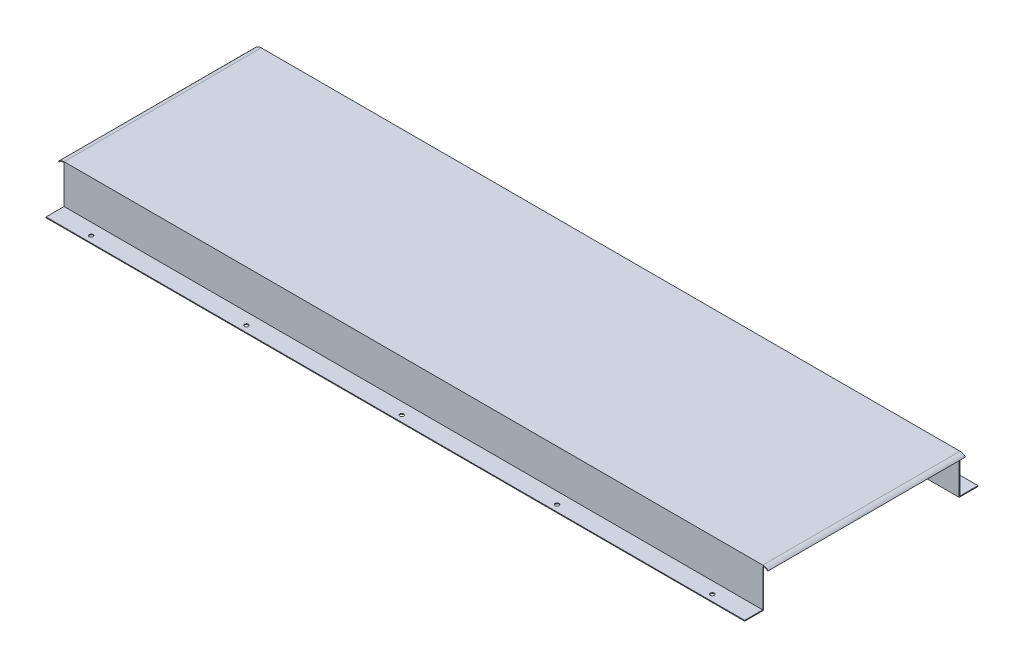
ISO-10303-21;
HEADER;
FILE_DESCRIPTION(('STEP AP214'),'2;1');
FILE_NAME('part.step','',(''),(''),'','','');
FILE_SCHEMA(('AUTOMOTIVE_DESIGN { 1 0 10303 214 1 1 1 1 }'));
ENDSEC;
DATA;
#1=APPLICATION_CONTEXT('core data for automotive mechanical design processes');
#2=APPLICATION_PROTOCOL_DEFINITION('international standard','automotive_design',2000,#1);
#3=PRODUCT_CONTEXT('',#1,'mechanical');
#4=PRODUCT('Part','Part','',(#3));
#5=PRODUCT_RELATED_PRODUCT_CATEGORY('part','',(#4));
#6=PRODUCT_DEFINITION_FORMATION('','',#4);
#7=PRODUCT_DEFINITION_CONTEXT('part definition',#1,'design');
#8=PRODUCT_DEFINITION('design','',#6,#7);
#9=PRODUCT_DEFINITION_SHAPE('','',#8);
#10=(LENGTH_UNIT() NAMED_UNIT(*) SI_UNIT(.MILLI.,.METRE.));
#11=(NAMED_UNIT(*) PLANE_ANGLE_UNIT() SI_UNIT($,.RADIAN.));
#12=(NAMED_UNIT(*) SI_UNIT($,.STERADIAN.) SOLID_ANGLE_UNIT());
#13=UNCERTAINTY_MEASURE_WITH_UNIT(LENGTH_MEASURE(1.E-05),#10,'distance_accuracy_value','');
#14=(GEOMETRIC_REPRESENTATION_CONTEXT(3) GLOBAL_UNCERTAINTY_ASSIGNED_CONTEXT((#13)) GLOBAL_UNIT_ASSIGNED_CONTEXT((#10,
#11,#12)) REPRESENTATION_CONTEXT('',''));
#15=CARTESIAN_POINT('',(0.,0.,0.));
#16=DIRECTION('',(0.,0.,1.));
#17=DIRECTION('',(1.,0.,0.));
#18=AXIS2_PLACEMENT_3D('',#15,#16,#17);
#19=CARTESIAN_POINT('',(-450.,15.5000000000001,254.));
#20=DIRECTION('',(0.,0.,-1.));
#21=DIRECTION('',(1.,0.,0.));
#22=AXIS2_PLACEMENT_3D('',#19,#20,#21);
#23=PLANE('',#22);
#24=DIRECTION('',(-1.,0.,0.));
#25=VECTOR('',#24,1.);
#26=CARTESIAN_POINT('',(-450.,-24.4999999999999,254.));
#27=LINE('',#26,#25);
#28=CARTESIAN_POINT('',(450.,-24.4999999999999,254.));
#29=VERTEX_POINT('',#28);
#30=CARTESIAN_POINT('',(-450.,-24.4999999999999,254.));
#31=VERTEX_POINT('',#30);
#32=EDGE_CURVE('E54',#29,#31,#27,.T.);
#33=ORIENTED_EDGE('',*,*,#32,.F.);
#34=DIRECTION('',(0.,1.,0.));
#35=VECTOR('',#34,1.);
#36=CARTESIAN_POINT('',(450.,25.5000000000001,254.));
#37=LINE('',#36,#35);
#38=CARTESIAN_POINT('',(450.,24.5000000000001,254.));
#39=VERTEX_POINT('',#38);
#40=EDGE_CURVE('E202',#29,#39,#37,.T.);
#41=ORIENTED_EDGE('',*,*,#40,.T.);
#42=CARTESIAN_POINT('',(450.,15.5000000000002,254.));
#43=DIRECTION('',(0.,0.,-1.));
#44=DIRECTION('',(-1.,0.,0.));
#45=AXIS2_PLACEMENT_3D('',#42,#43,#44);
#46=CIRCLE('',#45,8.9999999999999);
#47=CARTESIAN_POINT('',(456.363961030679,21.863961030679,254.));
#48=VERTEX_POINT('',#47);
#49=EDGE_CURVE('E222',#39,#48,#46,.T.);
#50=ORIENTED_EDGE('',*,*,#49,.T.);
#51=DIRECTION('',(0.70710678118653,0.707106781186565,0.));
#52=VECTOR('',#51,1.);
#53=CARTESIAN_POINT('',(456.363961030679,21.863961030679,254.));
#54=LINE('',#53,#52);
#55=CARTESIAN_POINT('',(457.071067811865,22.5710678118656,254.));
#56=VERTEX_POINT('',#55);
#57=EDGE_CURVE('E219',#48,#56,#54,.T.);
#58=ORIENTED_EDGE('',*,*,#57,.T.);
#59=CARTESIAN_POINT('',(450.,15.5000000000002,254.));
#60=DIRECTION('',(0.,0.,1.));
#61=DIRECTION('',(-1.,0.,0.));
#62=AXIS2_PLACEMENT_3D('',#59,#60,#61);
#63=CIRCLE('',#62,9.99999999999989);
#64=CARTESIAN_POINT('',(450.,25.5000000000001,254.));
#65=VERTEX_POINT('',#64);
#66=EDGE_CURVE('E216',#56,#65,#63,.T.);
#67=ORIENTED_EDGE('',*,*,#66,.T.);
#68=DIRECTION('',(-1.,0.,0.));
#69=VECTOR('',#68,1.);
#70=CARTESIAN_POINT('',(450.,25.5000000000001,254.));
#71=LINE('',#70,#69);
#72=CARTESIAN_POINT('',(-450.,25.5,254.));
#73=VERTEX_POINT('',#72);
#74=EDGE_CURVE('E209',#65,#73,#71,.T.);
#75=ORIENTED_EDGE('',*,*,#74,.T.);
#76=CARTESIAN_POINT('',(-450.,15.5000000000001,254.));
#77=DIRECTION('',(0.,0.,1.));
#78=DIRECTION('',(1.,0.,0.));
#79=AXIS2_PLACEMENT_3D('',#76,#77,#78);
#80=CIRCLE('',#79,9.99999999999989);
#81=CARTESIAN_POINT('',(-457.071067811866,22.5710678118655,254.));
#82=VERTEX_POINT('',#81);
#83=EDGE_CURVE('E228',#73,#82,#80,.T.);
#84=ORIENTED_EDGE('',*,*,#83,.T.);
#85=DIRECTION('',(0.707106781186567,-0.707106781186528,0.));
#86=VECTOR('',#85,1.);
#87=CARTESIAN_POINT('',(-456.363961030679,21.863961030679,254.));
#88=LINE('',#87,#86);
#89=CARTESIAN_POINT('',(-456.363961030679,21.863961030679,254.));
#90=VERTEX_POINT('',#89);
#91=EDGE_CURVE('E234',#82,#90,#88,.T.);
#92=ORIENTED_EDGE('',*,*,#91,.T.);
#93=CARTESIAN_POINT('',(-450.,15.5000000000001,254.));
#94=DIRECTION('',(0.,0.,-1.));
#95=DIRECTION('',(1.,0.,0.));
#96=AXIS2_PLACEMENT_3D('',#93,#94,#95);
#97=CIRCLE('',#96,8.99999999999988);
#98=CARTESIAN_POINT('',(-450.,24.4999999999999,254.));
#99=VERTEX_POINT('',#98);
#100=EDGE_CURVE('E231',#90,#99,#97,.T.);
#101=ORIENTED_EDGE('',*,*,#100,.T.);
#102=DIRECTION('',(0.,-1.,0.));
#103=VECTOR('',#102,1.);
#104=CARTESIAN_POINT('',(-450.,25.5,254.));
#105=LINE('',#104,#103);
#106=EDGE_CURVE('E197',#99,#31,#105,.T.);
#107=ORIENTED_EDGE('',*,*,#106,.T.);
#108=EDGE_LOOP('',(#33,#41,#50,#58,#67,#75,#84,#92,#101,#107));
#109=FACE_BOUND('',#108,.T.);
#110=ADVANCED_FACE('F37',(#109),#23,.F.);
#111=CARTESIAN_POINT('',(450.,25.5000000000001,1.));
#112=DIRECTION('',(-1.,0.,0.));
#113=DIRECTION('',(0.,0.,1.));
#114=AXIS2_PLACEMENT_3D('',#111,#112,#113);
#115=PLANE('',#114);
#116=DIRECTION('',(0.,0.,-1.));
#117=VECTOR('',#116,1.);
#118=CARTESIAN_POINT('',(450.,24.5000000000001,127.));
#119=LINE('',#118,#117);
#120=CARTESIAN_POINT('',(450.,24.5000000000001,1.));
#121=VERTEX_POINT('',#120);
#122=CARTESIAN_POINT('',(450.,24.5000000000001,0.));
#123=VERTEX_POINT('',#122);
#124=EDGE_CURVE('E11',#121,#123,#119,.T.);
#125=ORIENTED_EDGE('',*,*,#124,.F.);
#126=DIRECTION('',(0.,1.,0.));
#127=VECTOR('',#126,1.);
#128=CARTESIAN_POINT('',(450.,25.5000000000001,1.));
#129=LINE('',#128,#127);
#130=CARTESIAN_POINT('',(450.,-25.4999999999999,1.));
#131=VERTEX_POINT('',#130);
#132=EDGE_CURVE('E313',#131,#121,#129,.T.);
#133=ORIENTED_EDGE('',*,*,#132,.F.);
#134=DIRECTION('',(0.,0.,-1.));
#135=VECTOR('',#134,1.);
#136=CARTESIAN_POINT('',(450.,-25.4999999999999,1.));
#137=LINE('',#136,#135);
#138=CARTESIAN_POINT('',(450.,-25.4999999999999,-23.25));
#139=VERTEX_POINT('',#138);
#140=EDGE_CURVE('E325',#131,#139,#137,.T.);
#141=ORIENTED_EDGE('',*,*,#140,.T.);
#142=DIRECTION('',(0.,1.,0.));
#143=VECTOR('',#142,1.);
#144=CARTESIAN_POINT('',(450.,-24.4999999999999,-23.25));
#145=LINE('',#144,#143);
#146=CARTESIAN_POINT('',(450.,-24.4999999999999,-23.25));
#147=VERTEX_POINT('',#146);
#148=EDGE_CURVE('E294',#139,#147,#145,.T.);
#149=ORIENTED_EDGE('',*,*,#148,.T.);
#150=DIRECTION('',(0.,0.,1.));
#151=VECTOR('',#150,1.);
#152=CARTESIAN_POINT('',(450.,-24.4999999999999,-23.25));
#153=LINE('',#152,#151);
#154=CARTESIAN_POINT('',(450.,-24.4999999999999,0.));
#155=VERTEX_POINT('',#154);
#156=EDGE_CURVE('E300',#147,#155,#153,.T.);
#157=ORIENTED_EDGE('',*,*,#156,.T.);
#158=DIRECTION('',(0.,1.,0.));
#159=VECTOR('',#158,1.);
#160=CARTESIAN_POINT('',(450.,25.5000000000001,0.));
#161=LINE('',#160,#159);
#162=EDGE_CURVE('E318',#155,#123,#161,.T.);
#163=ORIENTED_EDGE('',*,*,#162,.T.);
#164=EDGE_LOOP('',(#125,#133,#141,#149,#157,#163));
#165=FACE_BOUND('',#164,.T.);
#166=ADVANCED_FACE('F435',(#165),#115,.F.);
#167=CARTESIAN_POINT('',(-400.,-25.5,-15.));
#168=DIRECTION('',(0.,1.,0.));
#169=DIRECTION('',(0.,0.,1.));
#170=AXIS2_PLACEMENT_3D('',#167,#168,#169);
#171=CYLINDRICAL_SURFACE('',#170,2.50000000000002);
#172=CARTESIAN_POINT('',(-400.,-24.4999999999999,-15.));
#173=DIRECTION('',(0.,1.,0.));
#174=DIRECTION('',(0.,0.,1.));
#175=AXIS2_PLACEMENT_3D('',#172,#173,#174);
#176=CIRCLE('',#175,2.50000000000002);
#177=CARTESIAN_POINT('',(-400.,-24.4999999999999,-12.5));
#178=VERTEX_POINT('',#177);
#179=EDGE_CURVE('E343',#178,#178,#176,.T.);
#180=ORIENTED_EDGE('',*,*,#179,.T.);
#181=EDGE_LOOP('',(#180));
#182=FACE_BOUND('',#181,.T.);
#183=CARTESIAN_POINT('',(-400.,-25.5,-15.));
#184=DIRECTION('',(0.,1.,0.));
#185=DIRECTION('',(0.,0.,1.));
#186=AXIS2_PLACEMENT_3D('',#183,#184,#185);
#187=CIRCLE('',#186,2.50000000000002);
#188=CARTESIAN_POINT('',(-400.,-25.5,-12.5));
#189=VERTEX_POINT('',#188);
#190=EDGE_CURVE('E263',#189,#189,#187,.T.);
#191=ORIENTED_EDGE('',*,*,#190,.F.);
#192=EDGE_LOOP('',(#191));
#193=FACE_BOUND('',#192,.T.);
#194=ADVANCED_FACE('F39',(#182,#193),#171,.F.);
#195=CARTESIAN_POINT('',(-200.,-25.5,-15.));
#196=DIRECTION('',(0.,1.,0.));
#197=DIRECTION('',(0.,0.,1.));
#198=AXIS2_PLACEMENT_3D('',#195,#196,#197);
#199=CYLINDRICAL_SURFACE('',#198,2.50000000000002);
#200=CARTESIAN_POINT('',(-200.,-24.4999999999999,-15.));
#201=DIRECTION('',(0.,1.,0.));
#202=DIRECTION('',(0.,0.,1.));
#203=AXIS2_PLACEMENT_3D('',#200,#201,#202);
#204=CIRCLE('',#203,2.50000000000002);
#205=CARTESIAN_POINT('',(-200.,-24.4999999999999,-12.5));
#206=VERTEX_POINT('',#205);
#207=EDGE_CURVE('E337',#206,#206,#204,.T.);
#208=ORIENTED_EDGE('',*,*,#207,.T.);
#209=EDGE_LOOP('',(#208));
#210=FACE_BOUND('',#209,.T.);
#211=CARTESIAN_POINT('',(-200.,-25.5,-15.));
#212=DIRECTION('',(0.,1.,0.));
#213=DIRECTION('',(0.,0.,1.));
#214=AXIS2_PLACEMENT_3D('',#211,#212,#213);
#215=CIRCLE('',#214,2.50000000000002);
#216=CARTESIAN_POINT('',(-200.,-25.5,-12.5));
#217=VERTEX_POINT('',#216);
#218=EDGE_CURVE('E340',#217,#217,#215,.T.);
#219=ORIENTED_EDGE('',*,*,#218,.F.);
#220=EDGE_LOOP('',(#219));
#221=FACE_BOUND('',#220,.T.);
#222=ADVANCED_FACE('F483',(#210,#221),#199,.F.);
#223=CARTESIAN_POINT('',(-4.44089209850063E-13,-25.5,-15.));
#224=DIRECTION('',(0.,1.,0.));
#225=DIRECTION('',(0.,0.,1.));
#226=AXIS2_PLACEMENT_3D('',#223,#224,#225);
#227=CYLINDRICAL_SURFACE('',#226,2.50000000000002);
#228=CARTESIAN_POINT('',(-4.44089209850063E-13,-24.4999999999999,-15.));
#229=DIRECTION('',(0.,1.,0.));
#230=DIRECTION('',(0.,0.,1.));
#231=AXIS2_PLACEMENT_3D('',#228,#229,#230);
#232=CIRCLE('',#231,2.50000000000002);
#233=CARTESIAN_POINT('',(-4.44089209850063E-13,-24.4999999999999,-12.5));
#234=VERTEX_POINT('',#233);
#235=EDGE_CURVE('E329',#234,#234,#232,.T.);
#236=ORIENTED_EDGE('',*,*,#235,.T.);
#237=EDGE_LOOP('',(#236));
#238=FACE_BOUND('',#237,.T.);
#239=CARTESIAN_POINT('',(-4.44089209850063E-13,-25.5,-15.));
#240=DIRECTION('',(0.,1.,0.));
#241=DIRECTION('',(0.,0.,1.));
#242=AXIS2_PLACEMENT_3D('',#239,#240,#241);
#243=CIRCLE('',#242,2.50000000000002);
#244=CARTESIAN_POINT('',(-4.44089209850063E-13,-25.5,-12.5));
#245=VERTEX_POINT('',#244);
#246=EDGE_CURVE('E334',#245,#245,#243,.T.);
#247=ORIENTED_EDGE('',*,*,#246,.F.);
#248=EDGE_LOOP('',(#247));
#249=FACE_BOUND('',#248,.T.);
#250=ADVANCED_FACE('F470',(#238,#249),#227,.F.);
#251=CARTESIAN_POINT('',(0.,0.,1.));
#252=DIRECTION('',(0.,0.,-1.));
#253=DIRECTION('',(-1.,0.,0.));
#254=AXIS2_PLACEMENT_3D('',#251,#252,#253);
#255=PLANE('',#254);
#256=DIRECTION('',(1.,0.,0.));
#257=VECTOR('',#256,1.);
#258=CARTESIAN_POINT('',(-450.,24.5000000000001,1.));
#259=LINE('',#258,#257);
#260=CARTESIAN_POINT('',(-450.,24.4999999999999,1.));
#261=VERTEX_POINT('',#260);
#262=EDGE_CURVE('E278',#261,#121,#259,.T.);
#263=ORIENTED_EDGE('',*,*,#262,.F.);
#264=DIRECTION('',(0.,-1.,0.));
#265=VECTOR('',#264,1.);
#266=CARTESIAN_POINT('',(-450.,25.5,1.));
#267=LINE('',#266,#265);
#268=CARTESIAN_POINT('',(-450.,-25.5,1.));
#269=VERTEX_POINT('',#268);
#270=EDGE_CURVE('E308',#261,#269,#267,.T.);
#271=ORIENTED_EDGE('',*,*,#270,.T.);
#272=DIRECTION('',(1.,0.,0.));
#273=VECTOR('',#272,1.);
#274=CARTESIAN_POINT('',(450.,-25.4999999999999,1.));
#275=LINE('',#274,#273);
#276=EDGE_CURVE('E310',#269,#131,#275,.T.);
#277=ORIENTED_EDGE('',*,*,#276,.T.);
#278=ORIENTED_EDGE('',*,*,#132,.T.);
#279=EDGE_LOOP('',(#263,#271,#277,#278));
#280=FACE_BOUND('',#279,.T.);
#281=ADVANCED_FACE('F468',(#280),#255,.F.);
#282=CARTESIAN_POINT('',(0.,0.,0.));
#283=DIRECTION('',(0.,0.,-1.));
#284=DIRECTION('',(-1.,0.,0.));
#285=AXIS2_PLACEMENT_3D('',#282,#283,#284);
#286=PLANE('',#285);
#287=ORIENTED_EDGE('',*,*,#162,.F.);
#288=DIRECTION('',(-1.,0.,0.));
#289=VECTOR('',#288,1.);
#290=CARTESIAN_POINT('',(-450.,-24.4999999999999,0.));
#291=LINE('',#290,#289);
#292=CARTESIAN_POINT('',(-450.,-24.4999999999999,0.));
#293=VERTEX_POINT('',#292);
#294=EDGE_CURVE('E287',#155,#293,#291,.T.);
#295=ORIENTED_EDGE('',*,*,#294,.T.);
#296=DIRECTION('',(0.,-1.,0.));
#297=VECTOR('',#296,1.);
#298=CARTESIAN_POINT('',(-450.,25.5,0.));
#299=LINE('',#298,#297);
#300=CARTESIAN_POINT('',(-450.,24.4999999999999,0.));
#301=VERTEX_POINT('',#300);
#302=EDGE_CURVE('E306',#301,#293,#299,.T.);
#303=ORIENTED_EDGE('',*,*,#302,.F.);
#304=CARTESIAN_POINT('',(-450.,15.5000000000001,0.));
#305=DIRECTION('',(0.,0.,-1.));
#306=DIRECTION('',(1.,0.,0.));
#307=AXIS2_PLACEMENT_3D('',#304,#305,#306);
#308=CIRCLE('',#307,8.99999999999988);
#309=CARTESIAN_POINT('',(-456.363961030679,21.863961030679,0.));
#310=VERTEX_POINT('',#309);
#311=EDGE_CURVE('E62',#310,#301,#308,.T.);
#312=ORIENTED_EDGE('',*,*,#311,.F.);
#313=DIRECTION('',(0.707106781186567,-0.707106781186528,0.));
#314=VECTOR('',#313,1.);
#315=CARTESIAN_POINT('',(-456.363961030679,21.863961030679,0.));
#316=LINE('',#315,#314);
#317=CARTESIAN_POINT('',(-457.071067811866,22.5710678118655,0.));
#318=VERTEX_POINT('',#317);
#319=EDGE_CURVE('E258',#318,#310,#316,.T.);
#320=ORIENTED_EDGE('',*,*,#319,.F.);
#321=CARTESIAN_POINT('',(-450.,15.5000000000001,0.));
#322=DIRECTION('',(0.,0.,1.));
#323=DIRECTION('',(1.,0.,0.));
#324=AXIS2_PLACEMENT_3D('',#321,#322,#323);
#325=CIRCLE('',#324,9.99999999999989);
#326=CARTESIAN_POINT('',(-450.,25.5,0.));
#327=VERTEX_POINT('',#326);
#328=EDGE_CURVE('E254',#327,#318,#325,.T.);
#329=ORIENTED_EDGE('',*,*,#328,.F.);
#330=DIRECTION('',(-1.,0.,0.));
#331=VECTOR('',#330,1.);
#332=CARTESIAN_POINT('',(450.,25.5000000000001,0.));
#333=LINE('',#332,#331);
#334=CARTESIAN_POINT('',(450.,25.5000000000001,0.));
#335=VERTEX_POINT('',#334);
#336=EDGE_CURVE('E311',#335,#327,#333,.T.);
#337=ORIENTED_EDGE('',*,*,#336,.F.);
#338=CARTESIAN_POINT('',(450.,15.5000000000002,0.));
#339=DIRECTION('',(0.,0.,1.));
#340=DIRECTION('',(-1.,0.,0.));
#341=AXIS2_PLACEMENT_3D('',#338,#339,#340);
#342=CIRCLE('',#341,9.99999999999989);
#343=CARTESIAN_POINT('',(457.071067811865,22.5710678118656,0.));
#344=VERTEX_POINT('',#343);
#345=EDGE_CURVE('E242',#344,#335,#342,.T.);
#346=ORIENTED_EDGE('',*,*,#345,.F.);
#347=DIRECTION('',(0.70710678118653,0.707106781186565,0.));
#348=VECTOR('',#347,1.);
#349=CARTESIAN_POINT('',(456.363961030679,21.863961030679,0.));
#350=LINE('',#349,#348);
#351=CARTESIAN_POINT('',(456.363961030679,21.863961030679,0.));
#352=VERTEX_POINT('',#351);
#353=EDGE_CURVE('E247',#352,#344,#350,.T.);
#354=ORIENTED_EDGE('',*,*,#353,.F.);
#355=CARTESIAN_POINT('',(450.,15.5000000000002,0.));
#356=DIRECTION('',(0.,0.,-1.));
#357=DIRECTION('',(-1.,0.,0.));
#358=AXIS2_PLACEMENT_3D('',#355,#356,#357);
#359=CIRCLE('',#358,8.9999999999999);
#360=EDGE_CURVE('E245',#123,#352,#359,.T.);
#361=ORIENTED_EDGE('',*,*,#360,.F.);
#362=EDGE_LOOP('',(#287,#295,#303,#312,#320,#329,#337,#346,#354,#361));
#363=FACE_BOUND('',#362,.T.);
#364=ADVANCED_FACE('F415',(#363),#286,.T.);
#365=CARTESIAN_POINT('',(-450.,25.5,1.));
#366=DIRECTION('',(1.,0.,0.));
#367=DIRECTION('',(0.,0.,-1.));
#368=AXIS2_PLACEMENT_3D('',#365,#366,#367);
#369=PLANE('',#368);
#370=ORIENTED_EDGE('',*,*,#270,.F.);
#371=DIRECTION('',(0.,0.,-1.));
#372=VECTOR('',#371,1.);
#373=CARTESIAN_POINT('',(-450.,24.4999999999999,127.));
#374=LINE('',#373,#372);
#375=EDGE_CURVE('E46',#261,#301,#374,.T.);
#376=ORIENTED_EDGE('',*,*,#375,.T.);
#377=ORIENTED_EDGE('',*,*,#302,.T.);
#378=DIRECTION('',(0.,0.,1.));
#379=VECTOR('',#378,1.);
#380=CARTESIAN_POINT('',(-450.,-24.4999999999999,-23.25));
#381=LINE('',#380,#379);
#382=CARTESIAN_POINT('',(-450.,-24.4999999999999,-23.25));
#383=VERTEX_POINT('',#382);
#384=EDGE_CURVE('E303',#383,#293,#381,.T.);
#385=ORIENTED_EDGE('',*,*,#384,.F.);
#386=DIRECTION('',(0.,-1.,0.));
#387=VECTOR('',#386,1.);
#388=CARTESIAN_POINT('',(-450.,-25.5,-23.25));
#389=LINE('',#388,#387);
#390=CARTESIAN_POINT('',(-450.,-25.5,-23.25));
#391=VERTEX_POINT('',#390);
#392=EDGE_CURVE('E288',#383,#391,#389,.T.);
#393=ORIENTED_EDGE('',*,*,#392,.T.);
#394=DIRECTION('',(0.,0.,-1.));
#395=VECTOR('',#394,1.);
#396=CARTESIAN_POINT('',(-450.,-25.5,1.));
#397=LINE('',#396,#395);
#398=EDGE_CURVE('E327',#269,#391,#397,.T.);
#399=ORIENTED_EDGE('',*,*,#398,.F.);
#400=EDGE_LOOP('',(#370,#376,#377,#385,#393,#399));
#401=FACE_BOUND('',#400,.T.);
#402=ADVANCED_FACE('F429',(#401),#369,.F.);
#403=CARTESIAN_POINT('',(450.,-25.4999999999999,1.));
#404=DIRECTION('',(0.,1.,0.));
#405=DIRECTION('',(-1.,0.,0.));
#406=AXIS2_PLACEMENT_3D('',#403,#404,#405);
#407=PLANE('',#406);
#408=CARTESIAN_POINT('',(200.,-25.5,-15.));
#409=DIRECTION('',(0.,1.,0.));
#410=DIRECTION('',(0.,0.,1.));
#411=AXIS2_PLACEMENT_3D('',#408,#409,#410);
#412=CIRCLE('',#411,2.50000000000002);
#413=CARTESIAN_POINT('',(200.,-25.5,-12.5));
#414=VERTEX_POINT('',#413);
#415=EDGE_CURVE('E271',#414,#414,#412,.T.);
#416=ORIENTED_EDGE('',*,*,#415,.T.);
#417=EDGE_LOOP('',(#416));
#418=FACE_BOUND('',#417,.T.);
#419=CARTESIAN_POINT('',(400.,-25.5,-15.));
#420=DIRECTION('',(0.,1.,0.));
#421=DIRECTION('',(0.,0.,1.));
#422=AXIS2_PLACEMENT_3D('',#419,#420,#421);
#423=CIRCLE('',#422,2.50000000000002);
#424=CARTESIAN_POINT('',(400.,-25.5,-12.5));
#425=VERTEX_POINT('',#424);
#426=EDGE_CURVE('E274',#425,#425,#423,.T.);
#427=ORIENTED_EDGE('',*,*,#426,.T.);
#428=EDGE_LOOP('',(#427));
#429=FACE_BOUND('',#428,.T.);
#430=ORIENTED_EDGE('',*,*,#398,.T.);
#431=DIRECTION('',(1.,0.,0.));
#432=VECTOR('',#431,1.);
#433=CARTESIAN_POINT('',(450.,-25.4999999999999,-23.25));
#434=LINE('',#433,#432);
#435=EDGE_CURVE('E291',#391,#139,#434,.T.);
#436=ORIENTED_EDGE('',*,*,#435,.T.);
#437=ORIENTED_EDGE('',*,*,#140,.F.);
#438=ORIENTED_EDGE('',*,*,#276,.F.);
#439=EDGE_LOOP('',(#430,#436,#437,#438));
#440=FACE_BOUND('',#439,.T.);
#441=ORIENTED_EDGE('',*,*,#246,.T.);
#442=EDGE_LOOP('',(#441));
#443=FACE_BOUND('',#442,.T.);
#444=ORIENTED_EDGE('',*,*,#218,.T.);
#445=EDGE_LOOP('',(#444));
#446=FACE_BOUND('',#445,.T.);
#447=ORIENTED_EDGE('',*,*,#190,.T.);
#448=EDGE_LOOP('',(#447));
#449=FACE_BOUND('',#448,.T.);
#450=ADVANCED_FACE('F420',(#418,#429,#440,#443,#446,#449),#407,.F.);
#451=CARTESIAN_POINT('',(450.,25.5000000000001,1.));
#452=DIRECTION('',(0.,-1.,0.));
#453=DIRECTION('',(1.,0.,0.));
#454=AXIS2_PLACEMENT_3D('',#451,#452,#453);
#455=PLANE('',#454);
#456=ORIENTED_EDGE('',*,*,#336,.T.);
#457=DIRECTION('',(0.,0.,-1.));
#458=VECTOR('',#457,1.);
#459=CARTESIAN_POINT('',(-450.,25.5,1.));
#460=LINE('',#459,#458);
#461=EDGE_CURVE('E316',#73,#327,#460,.T.);
#462=ORIENTED_EDGE('',*,*,#461,.F.);
#463=ORIENTED_EDGE('',*,*,#74,.F.);
#464=DIRECTION('',(0.,0.,-1.));
#465=VECTOR('',#464,1.);
#466=CARTESIAN_POINT('',(450.,25.5000000000001,1.));
#467=LINE('',#466,#465);
#468=EDGE_CURVE('E323',#65,#335,#467,.T.);
#469=ORIENTED_EDGE('',*,*,#468,.T.);
#470=EDGE_LOOP('',(#456,#462,#463,#469));
#471=FACE_BOUND('',#470,.T.);
#472=ADVANCED_FACE('F417',(#471),#455,.F.);
#473=CARTESIAN_POINT('',(-450.,-24.4999999999999,-23.25));
#474=DIRECTION('',(0.,1.,0.));
#475=DIRECTION('',(0.,0.,1.));
#476=AXIS2_PLACEMENT_3D('',#473,#474,#475);
#477=PLANE('',#476);
#478=CARTESIAN_POINT('',(200.,-24.4999999999999,-15.));
#479=DIRECTION('',(0.,1.,0.));
#480=DIRECTION('',(0.,0.,1.));
#481=AXIS2_PLACEMENT_3D('',#478,#479,#480);
#482=CIRCLE('',#481,2.50000000000002);
#483=CARTESIAN_POINT('',(200.,-24.4999999999999,-12.5));
#484=VERTEX_POINT('',#483);
#485=EDGE_CURVE('E268',#484,#484,#482,.T.);
#486=ORIENTED_EDGE('',*,*,#485,.F.);
#487=EDGE_LOOP('',(#486));
#488=FACE_BOUND('',#487,.T.);
#489=CARTESIAN_POINT('',(400.,-24.4999999999999,-15.));
#490=DIRECTION('',(0.,1.,0.));
#491=DIRECTION('',(0.,0.,1.));
#492=AXIS2_PLACEMENT_3D('',#489,#490,#491);
#493=CIRCLE('',#492,2.50000000000002);
#494=CARTESIAN_POINT('',(400.,-24.4999999999999,-12.5));
#495=VERTEX_POINT('',#494);
#496=EDGE_CURVE('E277',#495,#495,#493,.T.);
#497=ORIENTED_EDGE('',*,*,#496,.F.);
#498=EDGE_LOOP('',(#497));
#499=FACE_BOUND('',#498,.T.);
#500=ORIENTED_EDGE('',*,*,#294,.F.);
#501=ORIENTED_EDGE('',*,*,#156,.F.);
#502=DIRECTION('',(-1.,0.,0.));
#503=VECTOR('',#502,1.);
#504=CARTESIAN_POINT('',(-450.,-24.4999999999999,-23.25));
#505=LINE('',#504,#503);
#506=EDGE_CURVE('E297',#147,#383,#505,.T.);
#507=ORIENTED_EDGE('',*,*,#506,.T.);
#508=ORIENTED_EDGE('',*,*,#384,.T.);
#509=EDGE_LOOP('',(#500,#501,#507,#508));
#510=FACE_BOUND('',#509,.T.);
#511=ORIENTED_EDGE('',*,*,#235,.F.);
#512=EDGE_LOOP('',(#511));
#513=FACE_BOUND('',#512,.T.);
#514=ORIENTED_EDGE('',*,*,#207,.F.);
#515=EDGE_LOOP('',(#514));
#516=FACE_BOUND('',#515,.T.);
#517=ORIENTED_EDGE('',*,*,#179,.F.);
#518=EDGE_LOOP('',(#517));
#519=FACE_BOUND('',#518,.T.);
#520=ADVANCED_FACE('F419',(#488,#499,#510,#513,#516,#519),#477,.T.);
#521=CARTESIAN_POINT('',(0.,0.,-23.25));
#522=DIRECTION('',(0.,0.,-1.));
#523=DIRECTION('',(-1.,0.,0.));
#524=AXIS2_PLACEMENT_3D('',#521,#522,#523);
#525=PLANE('',#524);
#526=ORIENTED_EDGE('',*,*,#392,.F.);
#527=ORIENTED_EDGE('',*,*,#506,.F.);
#528=ORIENTED_EDGE('',*,*,#148,.F.);
#529=ORIENTED_EDGE('',*,*,#435,.F.);
#530=EDGE_LOOP('',(#526,#527,#528,#529));
#531=FACE_BOUND('',#530,.T.);
#532=ADVANCED_FACE('F426',(#531),#525,.T.);
#533=CARTESIAN_POINT('',(-450.,24.5000000000001,127.));
#534=DIRECTION('',(0.,1.,0.));
#535=DIRECTION('',(0.,0.,1.));
#536=AXIS2_PLACEMENT_3D('',#533,#534,#535);
#537=PLANE('',#536);
#538=ORIENTED_EDGE('',*,*,#262,.T.);
#539=DIRECTION('',(0.,0.,-1.));
#540=VECTOR('',#539,1.);
#541=CARTESIAN_POINT('',(450.,24.5000000000001,127.));
#542=LINE('',#541,#540);
#543=CARTESIAN_POINT('',(450.,24.5000000000001,253.));
#544=VERTEX_POINT('',#543);
#545=EDGE_CURVE('E281',#544,#121,#542,.T.);
#546=ORIENTED_EDGE('',*,*,#545,.F.);
#547=DIRECTION('',(1.,0.,0.));
#548=VECTOR('',#547,1.);
#549=CARTESIAN_POINT('',(-450.,24.5000000000001,253.));
#550=LINE('',#549,#548);
#551=CARTESIAN_POINT('',(-450.,24.4999999999999,253.));
#552=VERTEX_POINT('',#551);
#553=EDGE_CURVE('E240',#552,#544,#550,.T.);
#554=ORIENTED_EDGE('',*,*,#553,.F.);
#555=DIRECTION('',(0.,0.,-1.));
#556=VECTOR('',#555,1.);
#557=CARTESIAN_POINT('',(-450.,24.5000000000001,127.));
#558=LINE('',#557,#556);
#559=EDGE_CURVE('E284',#552,#261,#558,.T.);
#560=ORIENTED_EDGE('',*,*,#559,.T.);
#561=EDGE_LOOP('',(#538,#546,#554,#560));
#562=FACE_BOUND('',#561,.T.);
#563=ADVANCED_FACE('F409',(#562),#537,.F.);
#564=CARTESIAN_POINT('',(400.,-25.5,-15.));
#565=DIRECTION('',(0.,1.,0.));
#566=DIRECTION('',(0.,0.,1.));
#567=AXIS2_PLACEMENT_3D('',#564,#565,#566);
#568=CYLINDRICAL_SURFACE('',#567,2.50000000000002);
#569=ORIENTED_EDGE('',*,*,#496,.T.);
#570=EDGE_LOOP('',(#569));
#571=FACE_BOUND('',#570,.T.);
#572=ORIENTED_EDGE('',*,*,#426,.F.);
#573=EDGE_LOOP('',(#572));
#574=FACE_BOUND('',#573,.T.);
#575=ADVANCED_FACE('F458',(#571,#574),#568,.F.);
#576=CARTESIAN_POINT('',(200.,-25.5,-15.));
#577=DIRECTION('',(0.,1.,0.));
#578=DIRECTION('',(0.,0.,1.));
#579=AXIS2_PLACEMENT_3D('',#576,#577,#578);
#580=CYLINDRICAL_SURFACE('',#579,2.50000000000002);
#581=ORIENTED_EDGE('',*,*,#485,.T.);
#582=EDGE_LOOP('',(#581));
#583=FACE_BOUND('',#582,.T.);
#584=ORIENTED_EDGE('',*,*,#415,.F.);
#585=EDGE_LOOP('',(#584));
#586=FACE_BOUND('',#585,.T.);
#587=ADVANCED_FACE('F455',(#583,#586),#580,.F.);
#588=CARTESIAN_POINT('',(-450.,15.5000000000001,127.));
#589=DIRECTION('',(0.,0.,-1.));
#590=DIRECTION('',(-1.,0.,0.));
#591=AXIS2_PLACEMENT_3D('',#588,#589,#590);
#592=CYLINDRICAL_SURFACE('',#591,9.99999999999989);
#593=ORIENTED_EDGE('',*,*,#328,.T.);
#594=DIRECTION('',(0.,0.,-1.));
#595=VECTOR('',#594,1.);
#596=CARTESIAN_POINT('',(-457.071067811866,22.5710678118655,127.));
#597=LINE('',#596,#595);
#598=EDGE_CURVE('E265',#82,#318,#597,.T.);
#599=ORIENTED_EDGE('',*,*,#598,.F.);
#600=ORIENTED_EDGE('',*,*,#83,.F.);
#601=ORIENTED_EDGE('',*,*,#461,.T.);
#602=EDGE_LOOP('',(#593,#599,#600,#601));
#603=FACE_BOUND('',#602,.T.);
#604=ADVANCED_FACE('F396',(#603),#592,.T.);
#605=CARTESIAN_POINT('',(-456.363961030679,21.863961030679,127.));
#606=DIRECTION('',(0.707106781186528,0.707106781186567,0.));
#607=DIRECTION('',(-0.707106781186567,0.707106781186528,0.));
#608=AXIS2_PLACEMENT_3D('',#605,#606,#607);
#609=PLANE('',#608);
#610=ORIENTED_EDGE('',*,*,#319,.T.);
#611=DIRECTION('',(0.,0.,-1.));
#612=VECTOR('',#611,1.);
#613=CARTESIAN_POINT('',(-456.363961030679,21.863961030679,127.));
#614=LINE('',#613,#612);
#615=EDGE_CURVE('E261',#90,#310,#614,.T.);
#616=ORIENTED_EDGE('',*,*,#615,.F.);
#617=ORIENTED_EDGE('',*,*,#91,.F.);
#618=ORIENTED_EDGE('',*,*,#598,.T.);
#619=EDGE_LOOP('',(#610,#616,#617,#618));
#620=FACE_BOUND('',#619,.T.);
#621=ADVANCED_FACE('F399',(#620),#609,.F.);
#622=CARTESIAN_POINT('',(-450.,15.5000000000001,127.));
#623=DIRECTION('',(0.,0.,-1.));
#624=DIRECTION('',(-1.,0.,0.));
#625=AXIS2_PLACEMENT_3D('',#622,#623,#624);
#626=CYLINDRICAL_SURFACE('',#625,8.99999999999988);
#627=ORIENTED_EDGE('',*,*,#311,.T.);
#628=ORIENTED_EDGE('',*,*,#375,.F.);
#629=ORIENTED_EDGE('',*,*,#559,.F.);
#630=DIRECTION('',(0.,0.,1.));
#631=VECTOR('',#630,1.);
#632=CARTESIAN_POINT('',(-450.,24.4999999999999,127.));
#633=LINE('',#632,#631);
#634=EDGE_CURVE('E237',#552,#99,#633,.T.);
#635=ORIENTED_EDGE('',*,*,#634,.T.);
#636=ORIENTED_EDGE('',*,*,#100,.F.);
#637=ORIENTED_EDGE('',*,*,#615,.T.);
#638=EDGE_LOOP('',(#627,#628,#629,#635,#636,#637));
#639=FACE_BOUND('',#638,.T.);
#640=ADVANCED_FACE('F401',(#639),#626,.F.);
#641=CARTESIAN_POINT('',(450.,15.5000000000002,127.));
#642=DIRECTION('',(0.,0.,-1.));
#643=DIRECTION('',(-1.,0.,0.));
#644=AXIS2_PLACEMENT_3D('',#641,#642,#643);
#645=CYLINDRICAL_SURFACE('',#644,9.99999999999989);
#646=ORIENTED_EDGE('',*,*,#345,.T.);
#647=ORIENTED_EDGE('',*,*,#468,.F.);
#648=ORIENTED_EDGE('',*,*,#66,.F.);
#649=DIRECTION('',(0.,0.,-1.));
#650=VECTOR('',#649,1.);
#651=CARTESIAN_POINT('',(457.071067811865,22.5710678118656,127.));
#652=LINE('',#651,#650);
#653=EDGE_CURVE('E249',#56,#344,#652,.T.);
#654=ORIENTED_EDGE('',*,*,#653,.T.);
#655=EDGE_LOOP('',(#646,#647,#648,#654));
#656=FACE_BOUND('',#655,.T.);
#657=ADVANCED_FACE('F390',(#656),#645,.T.);
#658=CARTESIAN_POINT('',(450.,15.5000000000002,127.));
#659=DIRECTION('',(0.,0.,-1.));
#660=DIRECTION('',(-1.,0.,0.));
#661=AXIS2_PLACEMENT_3D('',#658,#659,#660);
#662=CYLINDRICAL_SURFACE('',#661,8.9999999999999);
#663=ORIENTED_EDGE('',*,*,#360,.T.);
#664=DIRECTION('',(0.,0.,-1.));
#665=VECTOR('',#664,1.);
#666=CARTESIAN_POINT('',(456.363961030679,21.863961030679,127.));
#667=LINE('',#666,#665);
#668=EDGE_CURVE('E252',#48,#352,#667,.T.);
#669=ORIENTED_EDGE('',*,*,#668,.F.);
#670=ORIENTED_EDGE('',*,*,#49,.F.);
#671=DIRECTION('',(0.,0.,1.));
#672=VECTOR('',#671,1.);
#673=CARTESIAN_POINT('',(450.,24.5000000000001,127.));
#674=LINE('',#673,#672);
#675=EDGE_CURVE('E225',#544,#39,#674,.T.);
#676=ORIENTED_EDGE('',*,*,#675,.F.);
#677=ORIENTED_EDGE('',*,*,#545,.T.);
#678=ORIENTED_EDGE('',*,*,#124,.T.);
#679=EDGE_LOOP('',(#663,#669,#670,#676,#677,#678));
#680=FACE_BOUND('',#679,.T.);
#681=ADVANCED_FACE('F382',(#680),#662,.F.);
#682=CARTESIAN_POINT('',(456.363961030679,21.863961030679,127.));
#683=DIRECTION('',(-0.707106781186565,0.70710678118653,0.));
#684=DIRECTION('',(-0.70710678118653,-0.707106781186565,0.));
#685=AXIS2_PLACEMENT_3D('',#682,#683,#684);
#686=PLANE('',#685);
#687=ORIENTED_EDGE('',*,*,#353,.T.);
#688=ORIENTED_EDGE('',*,*,#653,.F.);
#689=ORIENTED_EDGE('',*,*,#57,.F.);
#690=ORIENTED_EDGE('',*,*,#668,.T.);
#691=EDGE_LOOP('',(#687,#688,#689,#690));
#692=FACE_BOUND('',#691,.T.);
#693=ADVANCED_FACE('F386',(#692),#686,.F.);
#694=CARTESIAN_POINT('',(-450.,25.5,253.));
#695=DIRECTION('',(-1.,0.,0.));
#696=DIRECTION('',(0.,0.,1.));
#697=AXIS2_PLACEMENT_3D('',#694,#695,#696);
#698=PLANE('',#697);
#699=ORIENTED_EDGE('',*,*,#634,.F.);
#700=DIRECTION('',(0.,-1.,0.));
#701=VECTOR('',#700,1.);
#702=CARTESIAN_POINT('',(-450.,25.5,253.));
#703=LINE('',#702,#701);
#704=CARTESIAN_POINT('',(-450.,-25.5,253.));
#705=VERTEX_POINT('',#704);
#706=EDGE_CURVE('E199',#552,#705,#703,.T.);
#707=ORIENTED_EDGE('',*,*,#706,.T.);
#708=DIRECTION('',(0.,0.,1.));
#709=VECTOR('',#708,1.);
#710=CARTESIAN_POINT('',(-450.,-25.5,253.));
#711=LINE('',#710,#709);
#712=CARTESIAN_POINT('',(-450.,-25.5,277.25));
#713=VERTEX_POINT('',#712);
#714=EDGE_CURVE('E186',#705,#713,#711,.T.);
#715=ORIENTED_EDGE('',*,*,#714,.T.);
#716=DIRECTION('',(0.,-1.,0.));
#717=VECTOR('',#716,1.);
#718=CARTESIAN_POINT('',(-450.,-25.5,277.25));
#719=LINE('',#718,#717);
#720=CARTESIAN_POINT('',(-450.,-24.4999999999999,277.25));
#721=VERTEX_POINT('',#720);
#722=EDGE_CURVE('E170',#721,#713,#719,.T.);
#723=ORIENTED_EDGE('',*,*,#722,.F.);
#724=DIRECTION('',(0.,0.,-1.));
#725=VECTOR('',#724,1.);
#726=CARTESIAN_POINT('',(-450.,-24.4999999999999,277.25));
#727=LINE('',#726,#725);
#728=EDGE_CURVE('E178',#721,#31,#727,.T.);
#729=ORIENTED_EDGE('',*,*,#728,.T.);
#730=ORIENTED_EDGE('',*,*,#106,.F.);
#731=EDGE_LOOP('',(#699,#707,#715,#723,#729,#730));
#732=FACE_BOUND('',#731,.T.);
#733=ADVANCED_FACE('F184',(#732),#698,.T.);
#734=CARTESIAN_POINT('',(0.,0.,253.));
#735=DIRECTION('',(0.,0.,1.));
#736=DIRECTION('',(-1.,0.,0.));
#737=AXIS2_PLACEMENT_3D('',#734,#735,#736);
#738=PLANE('',#737);
#739=ORIENTED_EDGE('',*,*,#706,.F.);
#740=ORIENTED_EDGE('',*,*,#553,.T.);
#741=DIRECTION('',(0.,1.,0.));
#742=VECTOR('',#741,1.);
#743=CARTESIAN_POINT('',(450.,25.5000000000001,253.));
#744=LINE('',#743,#742);
#745=CARTESIAN_POINT('',(450.,-25.4999999999999,253.));
#746=VERTEX_POINT('',#745);
#747=EDGE_CURVE('E201',#746,#544,#744,.T.);
#748=ORIENTED_EDGE('',*,*,#747,.F.);
#749=DIRECTION('',(1.,0.,0.));
#750=VECTOR('',#749,1.);
#751=CARTESIAN_POINT('',(450.,-25.4999999999999,253.));
#752=LINE('',#751,#750);
#753=EDGE_CURVE('E205',#705,#746,#752,.T.);
#754=ORIENTED_EDGE('',*,*,#753,.F.);
#755=EDGE_LOOP('',(#739,#740,#748,#754));
#756=FACE_BOUND('',#755,.T.);
#757=ADVANCED_FACE('F406',(#756),#738,.F.);
#758=CARTESIAN_POINT('',(450.,25.5000000000001,253.));
#759=DIRECTION('',(1.,0.,0.));
#760=DIRECTION('',(0.,0.,-1.));
#761=AXIS2_PLACEMENT_3D('',#758,#759,#760);
#762=PLANE('',#761);
#763=ORIENTED_EDGE('',*,*,#675,.T.);
#764=ORIENTED_EDGE('',*,*,#40,.F.);
#765=DIRECTION('',(0.,0.,-1.));
#766=VECTOR('',#765,1.);
#767=CARTESIAN_POINT('',(450.,-24.4999999999999,277.25));
#768=LINE('',#767,#766);
#769=CARTESIAN_POINT('',(450.,-24.4999999999999,277.25));
#770=VERTEX_POINT('',#769);
#771=EDGE_CURVE('E181',#770,#29,#768,.T.);
#772=ORIENTED_EDGE('',*,*,#771,.F.);
#773=DIRECTION('',(0.,1.,0.));
#774=VECTOR('',#773,1.);
#775=CARTESIAN_POINT('',(450.,-24.4999999999999,277.25));
#776=LINE('',#775,#774);
#777=CARTESIAN_POINT('',(450.,-25.4999999999999,277.25));
#778=VERTEX_POINT('',#777);
#779=EDGE_CURVE('E172',#778,#770,#776,.T.);
#780=ORIENTED_EDGE('',*,*,#779,.F.);
#781=DIRECTION('',(0.,0.,1.));
#782=VECTOR('',#781,1.);
#783=CARTESIAN_POINT('',(450.,-25.4999999999999,253.));
#784=LINE('',#783,#782);
#785=EDGE_CURVE('E214',#746,#778,#784,.T.);
#786=ORIENTED_EDGE('',*,*,#785,.F.);
#787=ORIENTED_EDGE('',*,*,#747,.T.);
#788=EDGE_LOOP('',(#763,#764,#772,#780,#786,#787));
#789=FACE_BOUND('',#788,.T.);
#790=ADVANCED_FACE('F372',(#789),#762,.T.);
#791=CARTESIAN_POINT('',(450.,-25.4999999999999,253.));
#792=DIRECTION('',(0.,-1.,0.));
#793=DIRECTION('',(1.,0.,0.));
#794=AXIS2_PLACEMENT_3D('',#791,#792,#793);
#795=PLANE('',#794);
#796=CARTESIAN_POINT('',(200.,-25.5,269.));
#797=DIRECTION('',(0.,-1.,0.));
#798=DIRECTION('',(0.,0.,-1.));
#799=AXIS2_PLACEMENT_3D('',#796,#797,#798);
#800=CIRCLE('',#799,2.50000000000002);
#801=CARTESIAN_POINT('',(200.,-25.5,266.5));
#802=VERTEX_POINT('',#801);
#803=EDGE_CURVE('E354',#802,#802,#800,.T.);
#804=ORIENTED_EDGE('',*,*,#803,.F.);
#805=EDGE_LOOP('',(#804));
#806=FACE_BOUND('',#805,.T.);
#807=CARTESIAN_POINT('',(-4.44089209850063E-13,-25.5,269.));
#808=DIRECTION('',(0.,-1.,0.));
#809=DIRECTION('',(0.,0.,-1.));
#810=AXIS2_PLACEMENT_3D('',#807,#808,#809);
#811=CIRCLE('',#810,2.50000000000002);
#812=CARTESIAN_POINT('',(-4.44089209850063E-13,-25.5,266.5));
#813=VERTEX_POINT('',#812);
#814=EDGE_CURVE('E685',#813,#813,#811,.T.);
#815=ORIENTED_EDGE('',*,*,#814,.F.);
#816=EDGE_LOOP('',(#815));
#817=FACE_BOUND('',#816,.T.);
#818=CARTESIAN_POINT('',(-200.,-25.5,269.));
#819=DIRECTION('',(0.,-1.,0.));
#820=DIRECTION('',(0.,0.,-1.));
#821=AXIS2_PLACEMENT_3D('',#818,#819,#820);
#822=CIRCLE('',#821,2.50000000000002);
#823=CARTESIAN_POINT('',(-200.,-25.5,266.5));
#824=VERTEX_POINT('',#823);
#825=EDGE_CURVE('E688',#824,#824,#822,.T.);
#826=ORIENTED_EDGE('',*,*,#825,.F.);
#827=EDGE_LOOP('',(#826));
#828=FACE_BOUND('',#827,.T.);
#829=CARTESIAN_POINT('',(-400.000000000001,-25.5,269.));
#830=DIRECTION('',(0.,-1.,0.));
#831=DIRECTION('',(0.,0.,-1.));
#832=AXIS2_PLACEMENT_3D('',#829,#830,#831);
#833=CIRCLE('',#832,2.50000000000002);
#834=CARTESIAN_POINT('',(-400.000000000001,-25.5,266.5));
#835=VERTEX_POINT('',#834);
#836=EDGE_CURVE('E692',#835,#835,#833,.T.);
#837=ORIENTED_EDGE('',*,*,#836,.F.);
#838=EDGE_LOOP('',(#837));
#839=FACE_BOUND('',#838,.T.);
#840=CARTESIAN_POINT('',(400.,-25.5,269.));
#841=DIRECTION('',(0.,-1.,0.));
#842=DIRECTION('',(0.,0.,-1.));
#843=AXIS2_PLACEMENT_3D('',#840,#841,#842);
#844=CIRCLE('',#843,2.50000000000002);
#845=CARTESIAN_POINT('',(400.,-25.5,266.5));
#846=VERTEX_POINT('',#845);
#847=EDGE_CURVE('E192',#846,#846,#844,.T.);
#848=ORIENTED_EDGE('',*,*,#847,.F.);
#849=EDGE_LOOP('',(#848));
#850=FACE_BOUND('',#849,.T.);
#851=ORIENTED_EDGE('',*,*,#785,.T.);
#852=DIRECTION('',(1.,0.,0.));
#853=VECTOR('',#852,1.);
#854=CARTESIAN_POINT('',(450.,-25.4999999999999,277.25));
#855=LINE('',#854,#853);
#856=EDGE_CURVE('E182',#713,#778,#855,.T.);
#857=ORIENTED_EDGE('',*,*,#856,.F.);
#858=ORIENTED_EDGE('',*,*,#714,.F.);
#859=ORIENTED_EDGE('',*,*,#753,.T.);
#860=EDGE_LOOP('',(#851,#857,#858,#859));
#861=FACE_BOUND('',#860,.T.);
#862=ADVANCED_FACE('F369',(#806,#817,#828,#839,#850,#861),#795,.T.);
#863=CARTESIAN_POINT('',(-450.,-24.4999999999999,277.25));
#864=DIRECTION('',(0.,-1.,0.));
#865=DIRECTION('',(0.,0.,-1.));
#866=AXIS2_PLACEMENT_3D('',#863,#864,#865);
#867=PLANE('',#866);
#868=CARTESIAN_POINT('',(200.,-24.4999999999999,269.));
#869=DIRECTION('',(0.,-1.,0.));
#870=DIRECTION('',(0.,0.,-1.));
#871=AXIS2_PLACEMENT_3D('',#868,#869,#870);
#872=CIRCLE('',#871,2.50000000000002);
#873=CARTESIAN_POINT('',(200.,-24.4999999999999,266.5));
#874=VERTEX_POINT('',#873);
#875=EDGE_CURVE('E41',#874,#874,#872,.F.);
#876=ORIENTED_EDGE('',*,*,#875,.F.);
#877=EDGE_LOOP('',(#876));
#878=FACE_BOUND('',#877,.T.);
#879=CARTESIAN_POINT('',(-4.44089209850063E-13,-24.4999999999999,269.));
#880=DIRECTION('',(0.,-1.,0.));
#881=DIRECTION('',(0.,0.,-1.));
#882=AXIS2_PLACEMENT_3D('',#879,#880,#881);
#883=CIRCLE('',#882,2.50000000000002);
#884=CARTESIAN_POINT('',(-4.44089209850063E-13,-24.4999999999999,266.5));
#885=VERTEX_POINT('',#884);
#886=EDGE_CURVE('E356',#885,#885,#883,.F.);
#887=ORIENTED_EDGE('',*,*,#886,.F.);
#888=EDGE_LOOP('',(#887));
#889=FACE_BOUND('',#888,.T.);
#890=CARTESIAN_POINT('',(-200.,-24.4999999999999,269.));
#891=DIRECTION('',(0.,-1.,0.));
#892=DIRECTION('',(0.,0.,-1.));
#893=AXIS2_PLACEMENT_3D('',#890,#891,#892);
#894=CIRCLE('',#893,2.50000000000002);
#895=CARTESIAN_POINT('',(-200.,-24.4999999999999,266.5));
#896=VERTEX_POINT('',#895);
#897=EDGE_CURVE('E353',#896,#896,#894,.F.);
#898=ORIENTED_EDGE('',*,*,#897,.F.);
#899=EDGE_LOOP('',(#898));
#900=FACE_BOUND('',#899,.T.);
#901=CARTESIAN_POINT('',(-400.000000000001,-24.4999999999999,269.));
#902=DIRECTION('',(0.,-1.,0.));
#903=DIRECTION('',(0.,0.,-1.));
#904=AXIS2_PLACEMENT_3D('',#901,#902,#903);
#905=CIRCLE('',#904,2.50000000000002);
#906=CARTESIAN_POINT('',(-400.000000000001,-24.4999999999999,266.5));
#907=VERTEX_POINT('',#906);
#908=EDGE_CURVE('E350',#907,#907,#905,.F.);
#909=ORIENTED_EDGE('',*,*,#908,.F.);
#910=EDGE_LOOP('',(#909));
#911=FACE_BOUND('',#910,.T.);
#912=CARTESIAN_POINT('',(400.,-24.4999999999999,269.));
#913=DIRECTION('',(0.,-1.,0.));
#914=DIRECTION('',(0.,0.,-1.));
#915=AXIS2_PLACEMENT_3D('',#912,#913,#914);
#916=CIRCLE('',#915,2.50000000000002);
#917=CARTESIAN_POINT('',(400.,-24.4999999999999,266.5));
#918=VERTEX_POINT('',#917);
#919=EDGE_CURVE('E189',#918,#918,#916,.F.);
#920=ORIENTED_EDGE('',*,*,#919,.F.);
#921=EDGE_LOOP('',(#920));
#922=FACE_BOUND('',#921,.T.);
#923=ORIENTED_EDGE('',*,*,#32,.T.);
#924=ORIENTED_EDGE('',*,*,#728,.F.);
#925=DIRECTION('',(-1.,0.,0.));
#926=VECTOR('',#925,1.);
#927=CARTESIAN_POINT('',(-450.,-24.4999999999999,277.25));
#928=LINE('',#927,#926);
#929=EDGE_CURVE('E165',#770,#721,#928,.T.);
#930=ORIENTED_EDGE('',*,*,#929,.F.);
#931=ORIENTED_EDGE('',*,*,#771,.T.);
#932=EDGE_LOOP('',(#923,#924,#930,#931));
#933=FACE_BOUND('',#932,.T.);
#934=ADVANCED_FACE('F179',(#878,#889,#900,#911,#922,#933),#867,.F.);
#935=CARTESIAN_POINT('',(0.,0.,277.25));
#936=DIRECTION('',(0.,0.,1.));
#937=DIRECTION('',(-1.,0.,0.));
#938=AXIS2_PLACEMENT_3D('',#935,#936,#937);
#939=PLANE('',#938);
#940=ORIENTED_EDGE('',*,*,#722,.T.);
#941=ORIENTED_EDGE('',*,*,#856,.T.);
#942=ORIENTED_EDGE('',*,*,#779,.T.);
#943=ORIENTED_EDGE('',*,*,#929,.T.);
#944=EDGE_LOOP('',(#940,#941,#942,#943));
#945=FACE_BOUND('',#944,.T.);
#946=ADVANCED_FACE('F167',(#945),#939,.T.);
#947=CARTESIAN_POINT('',(400.,-25.5,269.));
#948=DIRECTION('',(0.,1.,0.));
#949=DIRECTION('',(0.,0.,1.));
#950=AXIS2_PLACEMENT_3D('',#947,#948,#949);
#951=CYLINDRICAL_SURFACE('',#950,2.50000000000002);
#952=ORIENTED_EDGE('',*,*,#847,.T.);
#953=EDGE_LOOP('',(#952));
#954=FACE_BOUND('',#953,.T.);
#955=ORIENTED_EDGE('',*,*,#919,.T.);
#956=EDGE_LOOP('',(#955));
#957=FACE_BOUND('',#956,.T.);
#958=ADVANCED_FACE('F366',(#954,#957),#951,.F.);
#959=CARTESIAN_POINT('',(-400.000000000001,-25.5,269.));
#960=DIRECTION('',(0.,1.,0.));
#961=DIRECTION('',(0.,0.,1.));
#962=AXIS2_PLACEMENT_3D('',#959,#960,#961);
#963=CYLINDRICAL_SURFACE('',#962,2.50000000000002);
#964=ORIENTED_EDGE('',*,*,#836,.T.);
#965=EDGE_LOOP('',(#964));
#966=FACE_BOUND('',#965,.T.);
#967=ORIENTED_EDGE('',*,*,#908,.T.);
#968=EDGE_LOOP('',(#967));
#969=FACE_BOUND('',#968,.T.);
#970=ADVANCED_FACE('F640',(#966,#969),#963,.F.);
#971=CARTESIAN_POINT('',(-200.,-25.5,269.));
#972=DIRECTION('',(0.,1.,0.));
#973=DIRECTION('',(0.,0.,1.));
#974=AXIS2_PLACEMENT_3D('',#971,#972,#973);
#975=CYLINDRICAL_SURFACE('',#974,2.50000000000002);
#976=ORIENTED_EDGE('',*,*,#825,.T.);
#977=EDGE_LOOP('',(#976));
#978=FACE_BOUND('',#977,.T.);
#979=ORIENTED_EDGE('',*,*,#897,.T.);
#980=EDGE_LOOP('',(#979));
#981=FACE_BOUND('',#980,.T.);
#982=ADVANCED_FACE('F649',(#978,#981),#975,.F.);
#983=CARTESIAN_POINT('',(-4.44089209850063E-13,-25.5,269.));
#984=DIRECTION('',(0.,1.,0.));
#985=DIRECTION('',(0.,0.,1.));
#986=AXIS2_PLACEMENT_3D('',#983,#984,#985);
#987=CYLINDRICAL_SURFACE('',#986,2.50000000000002);
#988=ORIENTED_EDGE('',*,*,#814,.T.);
#989=EDGE_LOOP('',(#988));
#990=FACE_BOUND('',#989,.T.);
#991=ORIENTED_EDGE('',*,*,#886,.T.);
#992=EDGE_LOOP('',(#991));
#993=FACE_BOUND('',#992,.T.);
#994=ADVANCED_FACE('F659',(#990,#993),#987,.F.);
#995=CARTESIAN_POINT('',(200.,-25.5,269.));
#996=DIRECTION('',(0.,1.,0.));
#997=DIRECTION('',(0.,0.,1.));
#998=AXIS2_PLACEMENT_3D('',#995,#996,#997);
#999=CYLINDRICAL_SURFACE('',#998,2.50000000000002);
#1000=ORIENTED_EDGE('',*,*,#803,.T.);
#1001=EDGE_LOOP('',(#1000));
#1002=FACE_BOUND('',#1001,.T.);
#1003=ORIENTED_EDGE('',*,*,#875,.T.);
#1004=EDGE_LOOP('',(#1003));
#1005=FACE_BOUND('',#1004,.T.);
#1006=ADVANCED_FACE('F669',(#1002,#1005),#999,.F.);
#1007=CLOSED_SHELL('',(#110,#166,#194,#222,#250,#281,#364,#402,#450,#472,#520,#532,#563,#575,
#587,#604,#621,#640,#657,#681,#693,#733,#757,#790,#862,#934,#946,#958,#970,#982,#994,#1006));
#1008=MANIFOLD_SOLID_BREP('B2',#1007);
#1009=ADVANCED_BREP_SHAPE_REPRESENTATION('',(#18,#1008),#14);
#1010=SHAPE_DEFINITION_REPRESENTATION(#9,#1009);
ENDSEC;
END-ISO-10303-21;
